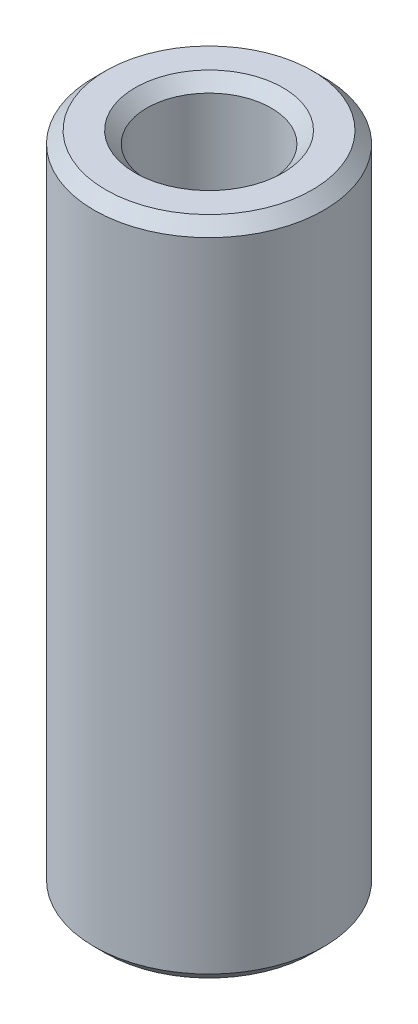
ISO-10303-21;
HEADER;
FILE_DESCRIPTION(('STEP AP214'),'2;1');
FILE_NAME('part.step','',(''),(''),'','','');
FILE_SCHEMA(('AUTOMOTIVE_DESIGN { 1 0 10303 214 1 1 1 1 }'));
ENDSEC;
DATA;
#1=APPLICATION_CONTEXT('core data for automotive mechanical design processes');
#2=APPLICATION_PROTOCOL_DEFINITION('international standard','automotive_design',2000,#1);
#3=PRODUCT_CONTEXT('',#1,'mechanical');
#4=PRODUCT('Part','Part','',(#3));
#5=PRODUCT_RELATED_PRODUCT_CATEGORY('part','',(#4));
#6=PRODUCT_DEFINITION_FORMATION('','',#4);
#7=PRODUCT_DEFINITION_CONTEXT('part definition',#1,'design');
#8=PRODUCT_DEFINITION('design','',#6,#7);
#9=PRODUCT_DEFINITION_SHAPE('','',#8);
#10=(LENGTH_UNIT() NAMED_UNIT(*) SI_UNIT(.MILLI.,.METRE.));
#11=(NAMED_UNIT(*) PLANE_ANGLE_UNIT() SI_UNIT($,.RADIAN.));
#12=(NAMED_UNIT(*) SI_UNIT($,.STERADIAN.) SOLID_ANGLE_UNIT());
#13=UNCERTAINTY_MEASURE_WITH_UNIT(LENGTH_MEASURE(1.E-05),#10,'distance_accuracy_value','');
#14=(GEOMETRIC_REPRESENTATION_CONTEXT(3) GLOBAL_UNCERTAINTY_ASSIGNED_CONTEXT((#13)) GLOBAL_UNIT_ASSIGNED_CONTEXT((#10,
#11,#12)) REPRESENTATION_CONTEXT('',''));
#15=CARTESIAN_POINT('',(0.,0.,0.));
#16=DIRECTION('',(0.,0.,1.));
#17=DIRECTION('',(1.,0.,0.));
#18=AXIS2_PLACEMENT_3D('',#15,#16,#17);
#19=CARTESIAN_POINT('',(0.,28.7578891883486,0.));
#20=DIRECTION('',(0.,-1.,0.));
#21=DIRECTION('',(0.,0.,-1.));
#22=AXIS2_PLACEMENT_3D('',#19,#20,#21);
#23=CYLINDRICAL_SURFACE('',#22,5.);
#24=CARTESIAN_POINT('',(0.,0.50992205317487,0.));
#25=DIRECTION('',(0.,1.,0.));
#26=DIRECTION('',(0.,0.,1.));
#27=AXIS2_PLACEMENT_3D('',#24,#25,#26);
#28=CIRCLE('',#27,5.);
#29=CARTESIAN_POINT('',(0.,0.50992205317487,5.));
#30=VERTEX_POINT('',#29);
#31=EDGE_CURVE('E10',#30,#30,#28,.T.);
#32=ORIENTED_EDGE('',*,*,#31,.T.);
#33=EDGE_LOOP('',(#32));
#34=FACE_BOUND('',#33,.T.);
#35=CARTESIAN_POINT('',(0.,28.2479671351737,0.));
#36=DIRECTION('',(0.,1.,0.));
#37=DIRECTION('',(0.,0.,1.));
#38=AXIS2_PLACEMENT_3D('',#35,#36,#37);
#39=CIRCLE('',#38,5.);
#40=CARTESIAN_POINT('',(0.,28.2479671351737,5.));
#41=VERTEX_POINT('',#40);
#42=EDGE_CURVE('E50',#41,#41,#39,.F.);
#43=ORIENTED_EDGE('',*,*,#42,.T.);
#44=EDGE_LOOP('',(#43));
#45=FACE_BOUND('',#44,.T.);
#46=ADVANCED_FACE('F39',(#34,#45),#23,.T.);
#47=CARTESIAN_POINT('',(0.,28.7578891883486,0.));
#48=DIRECTION('',(0.,1.,0.));
#49=DIRECTION('',(0.,0.,1.));
#50=AXIS2_PLACEMENT_3D('',#47,#48,#49);
#51=PLANE('',#50);
#52=CARTESIAN_POINT('',(0.,28.7578891883486,0.));
#53=DIRECTION('',(0.,1.,0.));
#54=DIRECTION('',(0.,0.,1.));
#55=AXIS2_PLACEMENT_3D('',#52,#53,#54);
#56=CIRCLE('',#55,3.2133368267255);
#57=CARTESIAN_POINT('',(0.,28.7578891883486,3.2133368267255));
#58=VERTEX_POINT('',#57);
#59=EDGE_CURVE('E58',#58,#58,#56,.F.);
#60=ORIENTED_EDGE('',*,*,#59,.T.);
#61=EDGE_LOOP('',(#60));
#62=FACE_BOUND('',#61,.T.);
#63=CARTESIAN_POINT('',(0.,28.7578891883486,0.));
#64=DIRECTION('',(0.,1.,0.));
#65=DIRECTION('',(0.,0.,1.));
#66=AXIS2_PLACEMENT_3D('',#63,#64,#65);
#67=CIRCLE('',#66,4.49007794682512);
#68=CARTESIAN_POINT('',(0.,28.7578891883486,4.49007794682512));
#69=VERTEX_POINT('',#68);
#70=EDGE_CURVE('E61',#69,#69,#67,.T.);
#71=ORIENTED_EDGE('',*,*,#70,.T.);
#72=EDGE_LOOP('',(#71));
#73=FACE_BOUND('',#72,.T.);
#74=ADVANCED_FACE('F88',(#62,#73),#51,.T.);
#75=CARTESIAN_POINT('',(0.,0.,0.));
#76=DIRECTION('',(0.,1.,0.));
#77=DIRECTION('',(0.,0.,1.));
#78=AXIS2_PLACEMENT_3D('',#75,#76,#77);
#79=PLANE('',#78);
#80=CARTESIAN_POINT('',(0.,0.,0.));
#81=DIRECTION('',(0.,1.,0.));
#82=DIRECTION('',(0.,0.,1.));
#83=AXIS2_PLACEMENT_3D('',#80,#81,#82);
#84=CIRCLE('',#83,3.21333682672549);
#85=CARTESIAN_POINT('',(0.,0.,3.21333682672549));
#86=VERTEX_POINT('',#85);
#87=EDGE_CURVE('E51',#86,#86,#84,.T.);
#88=ORIENTED_EDGE('',*,*,#87,.T.);
#89=EDGE_LOOP('',(#88));
#90=FACE_BOUND('',#89,.T.);
#91=CARTESIAN_POINT('',(0.,0.,0.));
#92=DIRECTION('',(0.,1.,0.));
#93=DIRECTION('',(0.,0.,1.));
#94=AXIS2_PLACEMENT_3D('',#91,#92,#93);
#95=CIRCLE('',#94,4.49007794682512);
#96=CARTESIAN_POINT('',(0.,0.,4.49007794682512));
#97=VERTEX_POINT('',#96);
#98=EDGE_CURVE('E54',#97,#97,#95,.F.);
#99=ORIENTED_EDGE('',*,*,#98,.T.);
#100=EDGE_LOOP('',(#99));
#101=FACE_BOUND('',#100,.T.);
#102=ADVANCED_FACE('F83',(#90,#101),#79,.F.);
#103=CARTESIAN_POINT('',(0.,28.7578891883486,0.));
#104=DIRECTION('',(0.,-1.,0.));
#105=DIRECTION('',(0.,0.,-1.));
#106=AXIS2_PLACEMENT_3D('',#103,#104,#105);
#107=CYLINDRICAL_SURFACE('',#106,2.70341477355061);
#108=CARTESIAN_POINT('',(0.,28.2479671351737,0.));
#109=DIRECTION('',(0.,1.,0.));
#110=DIRECTION('',(0.,0.,1.));
#111=AXIS2_PLACEMENT_3D('',#108,#109,#110);
#112=CIRCLE('',#111,2.70341477355061);
#113=CARTESIAN_POINT('',(0.,28.2479671351737,2.70341477355061));
#114=VERTEX_POINT('',#113);
#115=EDGE_CURVE('E67',#114,#114,#112,.T.);
#116=ORIENTED_EDGE('',*,*,#115,.T.);
#117=EDGE_LOOP('',(#116));
#118=FACE_BOUND('',#117,.T.);
#119=CARTESIAN_POINT('',(0.,0.509922053174884,0.));
#120=DIRECTION('',(0.,1.,0.));
#121=DIRECTION('',(0.,0.,1.));
#122=AXIS2_PLACEMENT_3D('',#119,#120,#121);
#123=CIRCLE('',#122,2.70341477355061);
#124=CARTESIAN_POINT('',(0.,0.509922053174884,2.70341477355061));
#125=VERTEX_POINT('',#124);
#126=EDGE_CURVE('E69',#125,#125,#123,.F.);
#127=ORIENTED_EDGE('',*,*,#126,.T.);
#128=EDGE_LOOP('',(#127));
#129=FACE_BOUND('',#128,.T.);
#130=ADVANCED_FACE('F71',(#118,#129),#107,.F.);
#131=CARTESIAN_POINT('',(0.,28.2479671351737,0.));
#132=DIRECTION('',(0.,1.,0.));
#133=DIRECTION('',(0.,0.,1.));
#134=AXIS2_PLACEMENT_3D('',#131,#132,#133);
#135=CONICAL_SURFACE('',#134,2.70341477355061,0.785398163397455);
#136=ORIENTED_EDGE('',*,*,#59,.F.);
#137=EDGE_LOOP('',(#136));
#138=FACE_BOUND('',#137,.T.);
#139=ORIENTED_EDGE('',*,*,#115,.F.);
#140=EDGE_LOOP('',(#139));
#141=FACE_BOUND('',#140,.T.);
#142=ADVANCED_FACE('F77',(#138,#141),#135,.F.);
#143=CARTESIAN_POINT('',(0.,0.,0.));
#144=DIRECTION('',(0.,-1.,0.));
#145=DIRECTION('',(0.,0.,-1.));
#146=AXIS2_PLACEMENT_3D('',#143,#144,#145);
#147=CONICAL_SURFACE('',#146,3.21333682672549,0.785398163397441);
#148=ORIENTED_EDGE('',*,*,#126,.F.);
#149=EDGE_LOOP('',(#148));
#150=FACE_BOUND('',#149,.T.);
#151=ORIENTED_EDGE('',*,*,#87,.F.);
#152=EDGE_LOOP('',(#151));
#153=FACE_BOUND('',#152,.T.);
#154=ADVANCED_FACE('F73',(#150,#153),#147,.F.);
#155=CARTESIAN_POINT('',(0.,0.50992205317487,0.));
#156=DIRECTION('',(0.,1.,0.));
#157=DIRECTION('',(0.,0.,1.));
#158=AXIS2_PLACEMENT_3D('',#155,#156,#157);
#159=CONICAL_SURFACE('',#158,5.,0.785398163397454);
#160=ORIENTED_EDGE('',*,*,#98,.F.);
#161=EDGE_LOOP('',(#160));
#162=FACE_BOUND('',#161,.T.);
#163=ORIENTED_EDGE('',*,*,#31,.F.);
#164=EDGE_LOOP('',(#163));
#165=FACE_BOUND('',#164,.T.);
#166=ADVANCED_FACE('F76',(#162,#165),#159,.T.);
#167=CARTESIAN_POINT('',(0.,28.7578891883486,0.));
#168=DIRECTION('',(0.,-1.,0.));
#169=DIRECTION('',(0.,0.,-1.));
#170=AXIS2_PLACEMENT_3D('',#167,#168,#169);
#171=CONICAL_SURFACE('',#170,4.49007794682512,0.785398163397441);
#172=ORIENTED_EDGE('',*,*,#42,.F.);
#173=EDGE_LOOP('',(#172));
#174=FACE_BOUND('',#173,.T.);
#175=ORIENTED_EDGE('',*,*,#70,.F.);
#176=EDGE_LOOP('',(#175));
#177=FACE_BOUND('',#176,.T.);
#178=ADVANCED_FACE('F45',(#174,#177),#171,.T.);
#179=CLOSED_SHELL('',(#46,#74,#102,#130,#142,#154,#166,#178));
#180=MANIFOLD_SOLID_BREP('B2',#179);
#181=ADVANCED_BREP_SHAPE_REPRESENTATION('',(#18,#180),#14);
#182=SHAPE_DEFINITION_REPRESENTATION(#9,#181);
ENDSEC;
END-ISO-10303-21;
